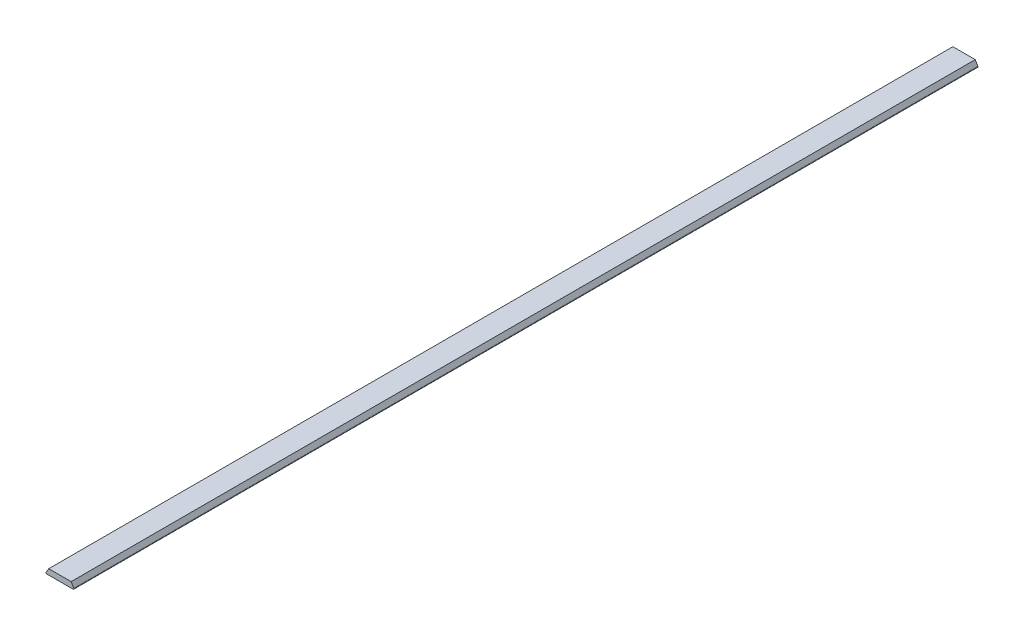
ISO-10303-21;
HEADER;
FILE_DESCRIPTION(('STEP AP214'),'2;1');
FILE_NAME('part.step','',(''),(''),'','','');
FILE_SCHEMA(('AUTOMOTIVE_DESIGN { 1 0 10303 214 1 1 1 1 }'));
ENDSEC;
DATA;
#1=APPLICATION_CONTEXT('core data for automotive mechanical design processes');
#2=APPLICATION_PROTOCOL_DEFINITION('international standard','automotive_design',2000,#1);
#3=PRODUCT_CONTEXT('',#1,'mechanical');
#4=PRODUCT('Part','Part','',(#3));
#5=PRODUCT_RELATED_PRODUCT_CATEGORY('part','',(#4));
#6=PRODUCT_DEFINITION_FORMATION('','',#4);
#7=PRODUCT_DEFINITION_CONTEXT('part definition',#1,'design');
#8=PRODUCT_DEFINITION('design','',#6,#7);
#9=PRODUCT_DEFINITION_SHAPE('','',#8);
#10=(LENGTH_UNIT() NAMED_UNIT(*) SI_UNIT(.MILLI.,.METRE.));
#11=(NAMED_UNIT(*) PLANE_ANGLE_UNIT() SI_UNIT($,.RADIAN.));
#12=(NAMED_UNIT(*) SI_UNIT($,.STERADIAN.) SOLID_ANGLE_UNIT());
#13=UNCERTAINTY_MEASURE_WITH_UNIT(LENGTH_MEASURE(1.E-05),#10,'distance_accuracy_value','');
#14=(GEOMETRIC_REPRESENTATION_CONTEXT(3) GLOBAL_UNCERTAINTY_ASSIGNED_CONTEXT((#13)) GLOBAL_UNIT_ASSIGNED_CONTEXT((#10,
#11,#12)) REPRESENTATION_CONTEXT('',''));
#15=CARTESIAN_POINT('',(0.,0.,0.));
#16=DIRECTION('',(0.,0.,1.));
#17=DIRECTION('',(1.,0.,0.));
#18=AXIS2_PLACEMENT_3D('',#15,#16,#17);
#19=CARTESIAN_POINT('',(23.9522259065887,0.749999999999999,889.));
#20=DIRECTION('',(0.,0.,-1.));
#21=DIRECTION('',(-1.,0.,0.));
#22=AXIS2_PLACEMENT_3D('',#19,#20,#21);
#23=CYLINDRICAL_SURFACE('',#22,0.749999999999998);
#24=CARTESIAN_POINT('',(23.9522259065887,0.749999999999999,0.));
#25=DIRECTION('',(0.,0.,1.));
#26=DIRECTION('',(1.,0.,0.));
#27=AXIS2_PLACEMENT_3D('',#24,#25,#26);
#28=CIRCLE('',#27,0.749999999999998);
#29=CARTESIAN_POINT('',(23.9522259065887,0.,0.));
#30=VERTEX_POINT('',#29);
#31=CARTESIAN_POINT('',(24.5968476335058,1.13335731268158,0.));
#32=VERTEX_POINT('',#31);
#33=EDGE_CURVE('E123',#30,#32,#28,.T.);
#34=ORIENTED_EDGE('',*,*,#33,.T.);
#35=DIRECTION('',(0.,0.,-1.));
#36=VECTOR('',#35,1.);
#37=CARTESIAN_POINT('',(24.5968476335058,1.13335731268158,889.));
#38=LINE('',#37,#36);
#39=CARTESIAN_POINT('',(24.5968476335058,1.13335731268158,889.));
#40=VERTEX_POINT('',#39);
#41=EDGE_CURVE('E47',#40,#32,#38,.T.);
#42=ORIENTED_EDGE('',*,*,#41,.F.);
#43=CARTESIAN_POINT('',(23.9522259065887,0.749999999999999,889.));
#44=DIRECTION('',(0.,0.,1.));
#45=DIRECTION('',(1.,0.,0.));
#46=AXIS2_PLACEMENT_3D('',#43,#44,#45);
#47=CIRCLE('',#46,0.749999999999998);
#48=CARTESIAN_POINT('',(23.9522259065887,0.,889.));
#49=VERTEX_POINT('',#48);
#50=EDGE_CURVE('E146',#49,#40,#47,.T.);
#51=ORIENTED_EDGE('',*,*,#50,.F.);
#52=DIRECTION('',(0.,0.,-1.));
#53=VECTOR('',#52,1.);
#54=CARTESIAN_POINT('',(23.9522259065887,0.,889.));
#55=LINE('',#54,#53);
#56=EDGE_CURVE('E11',#49,#30,#55,.T.);
#57=ORIENTED_EDGE('',*,*,#56,.T.);
#58=EDGE_LOOP('',(#34,#42,#51,#57));
#59=FACE_BOUND('',#58,.T.);
#60=ADVANCED_FACE('F39',(#59),#23,.T.);
#61=CARTESIAN_POINT('',(22.,5.5,889.));
#62=DIRECTION('',(-0.859495635889439,-0.511143083575439,0.));
#63=DIRECTION('',(0.511143083575439,-0.85949563588944,0.));
#64=AXIS2_PLACEMENT_3D('',#61,#62,#63);
#65=PLANE('',#64);
#66=DIRECTION('',(-0.511143083575439,0.859495635889439,0.));
#67=VECTOR('',#66,1.);
#68=CARTESIAN_POINT('',(22.,5.5,0.));
#69=LINE('',#68,#67);
#70=CARTESIAN_POINT('',(22.,5.5,0.));
#71=VERTEX_POINT('',#70);
#72=EDGE_CURVE('E125',#32,#71,#69,.T.);
#73=ORIENTED_EDGE('',*,*,#72,.T.);
#74=DIRECTION('',(0.,0.,-1.));
#75=VECTOR('',#74,1.);
#76=CARTESIAN_POINT('',(22.,5.5,889.));
#77=LINE('',#76,#75);
#78=CARTESIAN_POINT('',(22.,5.5,889.));
#79=VERTEX_POINT('',#78);
#80=EDGE_CURVE('E112',#79,#71,#77,.T.);
#81=ORIENTED_EDGE('',*,*,#80,.F.);
#82=DIRECTION('',(-0.511143083575439,0.859495635889439,0.));
#83=VECTOR('',#82,1.);
#84=CARTESIAN_POINT('',(22.,5.5,889.));
#85=LINE('',#84,#83);
#86=EDGE_CURVE('E103',#40,#79,#85,.T.);
#87=ORIENTED_EDGE('',*,*,#86,.F.);
#88=ORIENTED_EDGE('',*,*,#41,.T.);
#89=EDGE_LOOP('',(#73,#81,#87,#88));
#90=FACE_BOUND('',#89,.T.);
#91=ADVANCED_FACE('F138',(#90),#65,.F.);
#92=CARTESIAN_POINT('',(0.,5.5,889.));
#93=DIRECTION('',(0.,-1.,0.));
#94=DIRECTION('',(1.,0.,0.));
#95=AXIS2_PLACEMENT_3D('',#92,#93,#94);
#96=PLANE('',#95);
#97=DIRECTION('',(-1.,0.,0.));
#98=VECTOR('',#97,1.);
#99=CARTESIAN_POINT('',(0.,5.5,0.));
#100=LINE('',#99,#98);
#101=CARTESIAN_POINT('',(0.,5.5,0.));
#102=VERTEX_POINT('',#101);
#103=EDGE_CURVE('E111',#71,#102,#100,.T.);
#104=ORIENTED_EDGE('',*,*,#103,.T.);
#105=DIRECTION('',(0.,0.,-1.));
#106=VECTOR('',#105,1.);
#107=CARTESIAN_POINT('',(0.,5.5,889.));
#108=LINE('',#107,#106);
#109=CARTESIAN_POINT('',(0.,5.5,889.));
#110=VERTEX_POINT('',#109);
#111=EDGE_CURVE('E108',#110,#102,#108,.T.);
#112=ORIENTED_EDGE('',*,*,#111,.F.);
#113=DIRECTION('',(-1.,0.,0.));
#114=VECTOR('',#113,1.);
#115=CARTESIAN_POINT('',(0.,5.5,889.));
#116=LINE('',#115,#114);
#117=EDGE_CURVE('E97',#79,#110,#116,.T.);
#118=ORIENTED_EDGE('',*,*,#117,.F.);
#119=ORIENTED_EDGE('',*,*,#80,.T.);
#120=EDGE_LOOP('',(#104,#112,#118,#119));
#121=FACE_BOUND('',#120,.T.);
#122=ADVANCED_FACE('F109',(#121),#96,.F.);
#123=CARTESIAN_POINT('',(0.,5.5,889.));
#124=DIRECTION('',(0.85949563588944,-0.511143083575438,0.));
#125=DIRECTION('',(0.511143083575438,0.85949563588944,0.));
#126=AXIS2_PLACEMENT_3D('',#123,#124,#125);
#127=PLANE('',#126);
#128=DIRECTION('',(-0.511143083575438,-0.85949563588944,0.));
#129=VECTOR('',#128,1.);
#130=CARTESIAN_POINT('',(0.,5.5,0.));
#131=LINE('',#130,#129);
#132=CARTESIAN_POINT('',(-2.59684763350582,1.13335731268157,0.));
#133=VERTEX_POINT('',#132);
#134=EDGE_CURVE('E79',#102,#133,#131,.T.);
#135=ORIENTED_EDGE('',*,*,#134,.T.);
#136=DIRECTION('',(0.,0.,-1.));
#137=VECTOR('',#136,1.);
#138=CARTESIAN_POINT('',(-2.59684763350582,1.13335731268157,889.));
#139=LINE('',#138,#137);
#140=CARTESIAN_POINT('',(-2.59684763350582,1.13335731268157,889.));
#141=VERTEX_POINT('',#140);
#142=EDGE_CURVE('E113',#141,#133,#139,.T.);
#143=ORIENTED_EDGE('',*,*,#142,.F.);
#144=DIRECTION('',(-0.511143083575438,-0.85949563588944,0.));
#145=VECTOR('',#144,1.);
#146=CARTESIAN_POINT('',(0.,5.5,889.));
#147=LINE('',#146,#145);
#148=EDGE_CURVE('E101',#110,#141,#147,.T.);
#149=ORIENTED_EDGE('',*,*,#148,.F.);
#150=ORIENTED_EDGE('',*,*,#111,.T.);
#151=EDGE_LOOP('',(#135,#143,#149,#150));
#152=FACE_BOUND('',#151,.T.);
#153=ADVANCED_FACE('F115',(#152),#127,.F.);
#154=CARTESIAN_POINT('',(-1.95222590658874,0.749999999999996,889.));
#155=DIRECTION('',(0.,0.,-1.));
#156=DIRECTION('',(-1.,0.,0.));
#157=AXIS2_PLACEMENT_3D('',#154,#155,#156);
#158=CYLINDRICAL_SURFACE('',#157,0.749999999999998);
#159=CARTESIAN_POINT('',(-1.95222590658874,0.749999999999996,0.));
#160=DIRECTION('',(0.,0.,1.));
#161=DIRECTION('',(-1.,0.,0.));
#162=AXIS2_PLACEMENT_3D('',#159,#160,#161);
#163=CIRCLE('',#162,0.749999999999998);
#164=CARTESIAN_POINT('',(-1.95222590658874,0.,0.));
#165=VERTEX_POINT('',#164);
#166=EDGE_CURVE('E86',#133,#165,#163,.T.);
#167=ORIENTED_EDGE('',*,*,#166,.T.);
#168=DIRECTION('',(0.,0.,-1.));
#169=VECTOR('',#168,1.);
#170=CARTESIAN_POINT('',(-1.95222590658874,0.,889.));
#171=LINE('',#170,#169);
#172=CARTESIAN_POINT('',(-1.95222590658874,0.,889.));
#173=VERTEX_POINT('',#172);
#174=EDGE_CURVE('E119',#173,#165,#171,.T.);
#175=ORIENTED_EDGE('',*,*,#174,.F.);
#176=CARTESIAN_POINT('',(-1.95222590658874,0.749999999999996,889.));
#177=DIRECTION('',(0.,0.,1.));
#178=DIRECTION('',(-1.,0.,0.));
#179=AXIS2_PLACEMENT_3D('',#176,#177,#178);
#180=CIRCLE('',#179,0.749999999999998);
#181=EDGE_CURVE('E117',#141,#173,#180,.T.);
#182=ORIENTED_EDGE('',*,*,#181,.F.);
#183=ORIENTED_EDGE('',*,*,#142,.T.);
#184=EDGE_LOOP('',(#167,#175,#182,#183));
#185=FACE_BOUND('',#184,.T.);
#186=ADVANCED_FACE('F160',(#185),#158,.T.);
#187=CARTESIAN_POINT('',(-1.95222590658874,0.,889.));
#188=DIRECTION('',(0.,1.,0.));
#189=DIRECTION('',(0.,0.,1.));
#190=AXIS2_PLACEMENT_3D('',#187,#188,#189);
#191=PLANE('',#190);
#192=DIRECTION('',(1.,0.,0.));
#193=VECTOR('',#192,1.);
#194=CARTESIAN_POINT('',(-1.95222590658874,0.,0.));
#195=LINE('',#194,#193);
#196=EDGE_CURVE('E130',#165,#30,#195,.T.);
#197=ORIENTED_EDGE('',*,*,#196,.T.);
#198=ORIENTED_EDGE('',*,*,#56,.F.);
#199=DIRECTION('',(1.,0.,0.));
#200=VECTOR('',#199,1.);
#201=CARTESIAN_POINT('',(22.,0.,889.));
#202=LINE('',#201,#200);
#203=EDGE_CURVE('E55',#173,#49,#202,.T.);
#204=ORIENTED_EDGE('',*,*,#203,.F.);
#205=ORIENTED_EDGE('',*,*,#174,.T.);
#206=EDGE_LOOP('',(#197,#198,#204,#205));
#207=FACE_BOUND('',#206,.T.);
#208=ADVANCED_FACE('F145',(#207),#191,.F.);
#209=CARTESIAN_POINT('',(-1.95222590658874,0.749999999999996,889.));
#210=DIRECTION('',(0.,0.,-1.));
#211=DIRECTION('',(-1.,0.,0.));
#212=AXIS2_PLACEMENT_3D('',#209,#210,#211);
#213=PLANE('',#212);
#214=ORIENTED_EDGE('',*,*,#203,.T.);
#215=ORIENTED_EDGE('',*,*,#50,.T.);
#216=ORIENTED_EDGE('',*,*,#86,.T.);
#217=ORIENTED_EDGE('',*,*,#117,.T.);
#218=ORIENTED_EDGE('',*,*,#148,.T.);
#219=ORIENTED_EDGE('',*,*,#181,.T.);
#220=EDGE_LOOP('',(#214,#215,#216,#217,#218,#219));
#221=FACE_BOUND('',#220,.T.);
#222=ADVANCED_FACE('F99',(#221),#213,.F.);
#223=CARTESIAN_POINT('',(-1.95222590658874,0.749999999999996,0.));
#224=DIRECTION('',(0.,0.,-1.));
#225=DIRECTION('',(-1.,0.,0.));
#226=AXIS2_PLACEMENT_3D('',#223,#224,#225);
#227=PLANE('',#226);
#228=ORIENTED_EDGE('',*,*,#33,.F.);
#229=ORIENTED_EDGE('',*,*,#196,.F.);
#230=ORIENTED_EDGE('',*,*,#166,.F.);
#231=ORIENTED_EDGE('',*,*,#134,.F.);
#232=ORIENTED_EDGE('',*,*,#103,.F.);
#233=ORIENTED_EDGE('',*,*,#72,.F.);
#234=EDGE_LOOP('',(#228,#229,#230,#231,#232,#233));
#235=FACE_BOUND('',#234,.T.);
#236=ADVANCED_FACE('F143',(#235),#227,.T.);
#237=CLOSED_SHELL('',(#60,#91,#122,#153,#186,#208,#222,#236));
#238=MANIFOLD_SOLID_BREP('B2',#237);
#239=ADVANCED_BREP_SHAPE_REPRESENTATION('',(#18,#238),#14);
#240=SHAPE_DEFINITION_REPRESENTATION(#9,#239);
ENDSEC;
END-ISO-10303-21;
